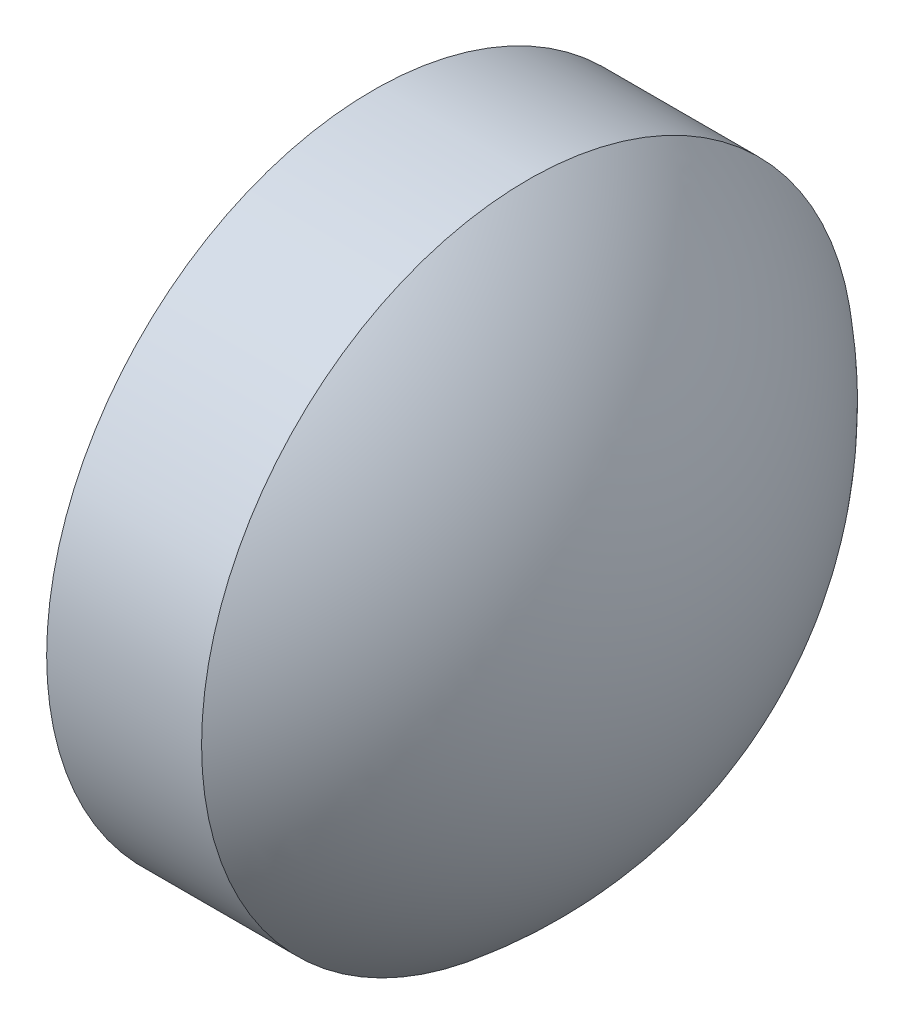
ISO-10303-21;
HEADER;
FILE_DESCRIPTION(('STEP AP214'),'2;1');
FILE_NAME('part.step','',(''),(''),'','','');
FILE_SCHEMA(('AUTOMOTIVE_DESIGN { 1 0 10303 214 1 1 1 1 }'));
ENDSEC;
DATA;
#1=APPLICATION_CONTEXT('core data for automotive mechanical design processes');
#2=APPLICATION_PROTOCOL_DEFINITION('international standard','automotive_design',2000,#1);
#3=PRODUCT_CONTEXT('',#1,'mechanical');
#4=PRODUCT('Part','Part','',(#3));
#5=PRODUCT_RELATED_PRODUCT_CATEGORY('part','',(#4));
#6=PRODUCT_DEFINITION_FORMATION('','',#4);
#7=PRODUCT_DEFINITION_CONTEXT('part definition',#1,'design');
#8=PRODUCT_DEFINITION('design','',#6,#7);
#9=PRODUCT_DEFINITION_SHAPE('','',#8);
#10=(LENGTH_UNIT() NAMED_UNIT(*) SI_UNIT(.MILLI.,.METRE.));
#11=(NAMED_UNIT(*) PLANE_ANGLE_UNIT() SI_UNIT($,.RADIAN.));
#12=(NAMED_UNIT(*) SI_UNIT($,.STERADIAN.) SOLID_ANGLE_UNIT());
#13=UNCERTAINTY_MEASURE_WITH_UNIT(LENGTH_MEASURE(1.E-05),#10,'distance_accuracy_value','');
#14=(GEOMETRIC_REPRESENTATION_CONTEXT(3) GLOBAL_UNCERTAINTY_ASSIGNED_CONTEXT((#13)) GLOBAL_UNIT_ASSIGNED_CONTEXT((#10,
#11,#12)) REPRESENTATION_CONTEXT('',''));
#15=CARTESIAN_POINT('',(0.,0.,0.));
#16=DIRECTION('',(0.,0.,1.));
#17=DIRECTION('',(1.,0.,0.));
#18=AXIS2_PLACEMENT_3D('',#15,#16,#17);
#19=CARTESIAN_POINT('',(385.034500590959,-62.7757247194712,0.00134873834287119));
#20=DIRECTION('',(0.,-1.,0.));
#21=DIRECTION('',(0.,0.,1.));
#22=AXIS2_PLACEMENT_3D('',#19,#20,#21);
#23=CIRCLE('',#22,2.58026315789473);
#24=TRIMMED_CURVE('',#23,(PARAMETER_VALUE(-1.57131904030191)),
(PARAMETER_VALUE(1.57131904030191)),.T.,.PARAMETER.);
#25=CARTESIAN_POINT('',(385.034500590959,-62.7757247194712,0.));
#26=DIRECTION('',(-1.,0.,0.));
#27=AXIS1_PLACEMENT('',#25,#26);
#28=SURFACE_OF_REVOLUTION('',#24,#27);
#29=CARTESIAN_POINT('',(386.664763748853,-62.7757247194712,0.));
#30=DIRECTION('',(-1.,0.,0.));
#31=DIRECTION('',(0.,0.,1.));
#32=AXIS2_PLACEMENT_3D('',#29,#30,#31);
#33=CIRCLE('',#32,2.00134873834285);
#34=CARTESIAN_POINT('',(386.664763748853,-62.7757247194712,2.00134873834285));
#35=VERTEX_POINT('',#34);
#36=EDGE_CURVE('E11',#35,#35,#33,.T.);
#37=ORIENTED_EDGE('',*,*,#36,.F.);
#38=EDGE_LOOP('',(#37));
#39=FACE_BOUND('',#38,.T.);
#40=CARTESIAN_POINT('',(387.614763396351,-62.7757247194712,0.));
#41=VERTEX_POINT('',#40);
#42=VERTEX_LOOP('',#41);
#43=FACE_BOUND('',#42,.T.);
#44=ADVANCED_FACE('F37',(#39,#43),#28,.T.);
#45=CARTESIAN_POINT('',(385.316161859755,-62.7757247194712,0.));
#46=DIRECTION('',(-1.,0.,0.));
#47=DIRECTION('',(0.,0.,1.));
#48=AXIS2_PLACEMENT_3D('',#45,#46,#47);
#49=CYLINDRICAL_SURFACE('',#48,2.00134873834285);
#50=CARTESIAN_POINT('',(385.714763748853,-62.7757247194712,0.));
#51=DIRECTION('',(-1.,0.,0.));
#52=DIRECTION('',(0.,0.,1.));
#53=AXIS2_PLACEMENT_3D('',#50,#51,#52);
#54=CIRCLE('',#53,2.00134873834285);
#55=CARTESIAN_POINT('',(385.714763748853,-62.7757247194712,2.00134873834285));
#56=VERTEX_POINT('',#55);
#57=EDGE_CURVE('E43',#56,#56,#54,.T.);
#58=ORIENTED_EDGE('',*,*,#57,.F.);
#59=EDGE_LOOP('',(#58));
#60=FACE_BOUND('',#59,.T.);
#61=ORIENTED_EDGE('',*,*,#36,.T.);
#62=EDGE_LOOP('',(#61));
#63=FACE_BOUND('',#62,.T.);
#64=ADVANCED_FACE('F47',(#60,#63),#49,.T.);
#65=CARTESIAN_POINT('',(385.714763748853,-62.7757247194712,0.));
#66=DIRECTION('',(1.,0.,0.));
#67=DIRECTION('',(0.,0.,-1.));
#68=AXIS2_PLACEMENT_3D('',#65,#66,#67);
#69=PLANE('',#68);
#70=ORIENTED_EDGE('',*,*,#57,.T.);
#71=EDGE_LOOP('',(#70));
#72=FACE_BOUND('',#71,.T.);
#73=ADVANCED_FACE('F52',(#72),#69,.F.);
#74=CLOSED_SHELL('',(#44,#64,#73));
#75=MANIFOLD_SOLID_BREP('B2',#74);
#76=ADVANCED_BREP_SHAPE_REPRESENTATION('',(#18,#75),#14);
#77=SHAPE_DEFINITION_REPRESENTATION(#9,#76);
ENDSEC;
END-ISO-10303-21;
